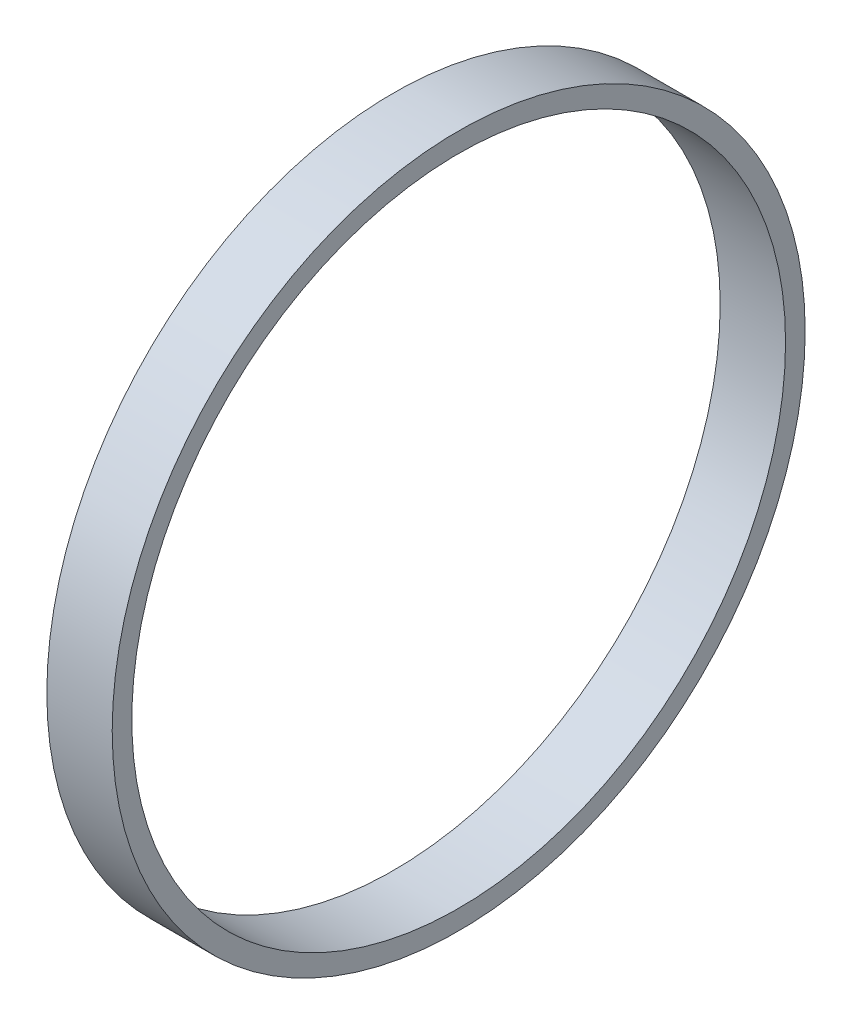
ISO-10303-21;
HEADER;
FILE_DESCRIPTION(('STEP AP214'),'2;1');
FILE_NAME('part.step','',(''),(''),'','','');
FILE_SCHEMA(('AUTOMOTIVE_DESIGN { 1 0 10303 214 1 1 1 1 }'));
ENDSEC;
DATA;
#1=APPLICATION_CONTEXT('core data for automotive mechanical design processes');
#2=APPLICATION_PROTOCOL_DEFINITION('international standard','automotive_design',2000,#1);
#3=PRODUCT_CONTEXT('',#1,'mechanical');
#4=PRODUCT('Part','Part','',(#3));
#5=PRODUCT_RELATED_PRODUCT_CATEGORY('part','',(#4));
#6=PRODUCT_DEFINITION_FORMATION('','',#4);
#7=PRODUCT_DEFINITION_CONTEXT('part definition',#1,'design');
#8=PRODUCT_DEFINITION('design','',#6,#7);
#9=PRODUCT_DEFINITION_SHAPE('','',#8);
#10=(LENGTH_UNIT() NAMED_UNIT(*) SI_UNIT(.MILLI.,.METRE.));
#11=(NAMED_UNIT(*) PLANE_ANGLE_UNIT() SI_UNIT($,.RADIAN.));
#12=(NAMED_UNIT(*) SI_UNIT($,.STERADIAN.) SOLID_ANGLE_UNIT());
#13=UNCERTAINTY_MEASURE_WITH_UNIT(LENGTH_MEASURE(1.E-05),#10,'distance_accuracy_value','');
#14=(GEOMETRIC_REPRESENTATION_CONTEXT(3) GLOBAL_UNCERTAINTY_ASSIGNED_CONTEXT((#13)) GLOBAL_UNIT_ASSIGNED_CONTEXT((#10,
#11,#12)) REPRESENTATION_CONTEXT('',''));
#15=CARTESIAN_POINT('',(0.,0.,0.));
#16=DIRECTION('',(0.,0.,1.));
#17=DIRECTION('',(1.,0.,0.));
#18=AXIS2_PLACEMENT_3D('',#15,#16,#17);
#19=CARTESIAN_POINT('',(5.,0.,0.));
#20=DIRECTION('',(1.,0.,0.));
#21=DIRECTION('',(0.,0.,-1.));
#22=AXIS2_PLACEMENT_3D('',#19,#20,#21);
#23=PLANE('',#22);
#24=CARTESIAN_POINT('',(5.,0.,0.));
#25=DIRECTION('',(1.,0.,0.));
#26=DIRECTION('',(0.,0.,-1.));
#27=AXIS2_PLACEMENT_3D('',#24,#25,#26);
#28=CIRCLE('',#27,26.5);
#29=CARTESIAN_POINT('',(5.,0.,-26.5));
#30=VERTEX_POINT('',#29);
#31=EDGE_CURVE('E10',#30,#30,#28,.T.);
#32=ORIENTED_EDGE('',*,*,#31,.T.);
#33=EDGE_LOOP('',(#32));
#34=FACE_BOUND('',#33,.T.);
#35=CARTESIAN_POINT('',(5.,0.,0.));
#36=DIRECTION('',(1.,0.,0.));
#37=DIRECTION('',(0.,0.,-1.));
#38=AXIS2_PLACEMENT_3D('',#35,#36,#37);
#39=CIRCLE('',#38,25.);
#40=CARTESIAN_POINT('',(5.,0.,-25.));
#41=VERTEX_POINT('',#40);
#42=EDGE_CURVE('E41',#41,#41,#39,.T.);
#43=ORIENTED_EDGE('',*,*,#42,.F.);
#44=EDGE_LOOP('',(#43));
#45=FACE_BOUND('',#44,.T.);
#46=ADVANCED_FACE('F30',(#34,#45),#23,.T.);
#47=CARTESIAN_POINT('',(0.,0.,0.));
#48=DIRECTION('',(1.,0.,0.));
#49=DIRECTION('',(0.,0.,-1.));
#50=AXIS2_PLACEMENT_3D('',#47,#48,#49);
#51=PLANE('',#50);
#52=CARTESIAN_POINT('',(0.,0.,0.));
#53=DIRECTION('',(1.,0.,0.));
#54=DIRECTION('',(0.,0.,-1.));
#55=AXIS2_PLACEMENT_3D('',#52,#53,#54);
#56=CIRCLE('',#55,26.5);
#57=CARTESIAN_POINT('',(0.,0.,-26.5));
#58=VERTEX_POINT('',#57);
#59=EDGE_CURVE('E34',#58,#58,#56,.T.);
#60=ORIENTED_EDGE('',*,*,#59,.F.);
#61=EDGE_LOOP('',(#60));
#62=FACE_BOUND('',#61,.T.);
#63=CARTESIAN_POINT('',(0.,0.,0.));
#64=DIRECTION('',(1.,0.,0.));
#65=DIRECTION('',(0.,0.,-1.));
#66=AXIS2_PLACEMENT_3D('',#63,#64,#65);
#67=CIRCLE('',#66,25.);
#68=CARTESIAN_POINT('',(0.,0.,-25.));
#69=VERTEX_POINT('',#68);
#70=EDGE_CURVE('E43',#69,#69,#67,.T.);
#71=ORIENTED_EDGE('',*,*,#70,.T.);
#72=EDGE_LOOP('',(#71));
#73=FACE_BOUND('',#72,.T.);
#74=ADVANCED_FACE('F53',(#62,#73),#51,.F.);
#75=CARTESIAN_POINT('',(5.,0.,0.));
#76=DIRECTION('',(-1.,0.,0.));
#77=DIRECTION('',(0.,0.,1.));
#78=AXIS2_PLACEMENT_3D('',#75,#76,#77);
#79=CYLINDRICAL_SURFACE('',#78,26.5);
#80=ORIENTED_EDGE('',*,*,#31,.F.);
#81=EDGE_LOOP('',(#80));
#82=FACE_BOUND('',#81,.T.);
#83=ORIENTED_EDGE('',*,*,#59,.T.);
#84=EDGE_LOOP('',(#83));
#85=FACE_BOUND('',#84,.T.);
#86=ADVANCED_FACE('F32',(#82,#85),#79,.T.);
#87=CARTESIAN_POINT('',(5.,0.,0.));
#88=DIRECTION('',(-1.,0.,0.));
#89=DIRECTION('',(0.,0.,1.));
#90=AXIS2_PLACEMENT_3D('',#87,#88,#89);
#91=CYLINDRICAL_SURFACE('',#90,25.);
#92=ORIENTED_EDGE('',*,*,#42,.T.);
#93=EDGE_LOOP('',(#92));
#94=FACE_BOUND('',#93,.T.);
#95=ORIENTED_EDGE('',*,*,#70,.F.);
#96=EDGE_LOOP('',(#95));
#97=FACE_BOUND('',#96,.T.);
#98=ADVANCED_FACE('F49',(#94,#97),#91,.F.);
#99=CLOSED_SHELL('',(#46,#74,#86,#98));
#100=MANIFOLD_SOLID_BREP('B2',#99);
#101=ADVANCED_BREP_SHAPE_REPRESENTATION('',(#18,#100),#14);
#102=SHAPE_DEFINITION_REPRESENTATION(#9,#101);
ENDSEC;
END-ISO-10303-21;
